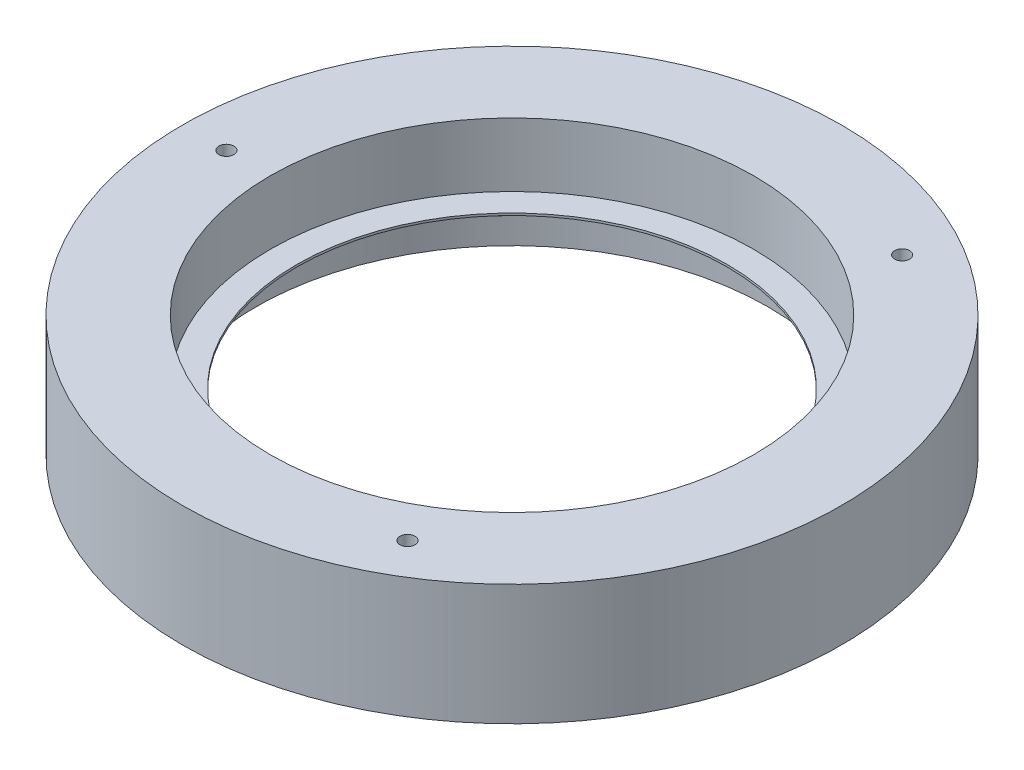
ISO-10303-21;
HEADER;
FILE_DESCRIPTION(('STEP AP214'),'2;1');
FILE_NAME('part.step','',(''),(''),'','','');
FILE_SCHEMA(('AUTOMOTIVE_DESIGN { 1 0 10303 214 1 1 1 1 }'));
ENDSEC;
DATA;
#1=APPLICATION_CONTEXT('core data for automotive mechanical design processes');
#2=APPLICATION_PROTOCOL_DEFINITION('international standard','automotive_design',2000,#1);
#3=PRODUCT_CONTEXT('',#1,'mechanical');
#4=PRODUCT('Part','Part','',(#3));
#5=PRODUCT_RELATED_PRODUCT_CATEGORY('part','',(#4));
#6=PRODUCT_DEFINITION_FORMATION('','',#4);
#7=PRODUCT_DEFINITION_CONTEXT('part definition',#1,'design');
#8=PRODUCT_DEFINITION('design','',#6,#7);
#9=PRODUCT_DEFINITION_SHAPE('','',#8);
#10=(LENGTH_UNIT() NAMED_UNIT(*) SI_UNIT(.MILLI.,.METRE.));
#11=(NAMED_UNIT(*) PLANE_ANGLE_UNIT() SI_UNIT($,.RADIAN.));
#12=(NAMED_UNIT(*) SI_UNIT($,.STERADIAN.) SOLID_ANGLE_UNIT());
#13=UNCERTAINTY_MEASURE_WITH_UNIT(LENGTH_MEASURE(1.E-05),#10,'distance_accuracy_value','');
#14=(GEOMETRIC_REPRESENTATION_CONTEXT(3) GLOBAL_UNCERTAINTY_ASSIGNED_CONTEXT((#13)) GLOBAL_UNIT_ASSIGNED_CONTEXT((#10,
#11,#12)) REPRESENTATION_CONTEXT('',''));
#15=CARTESIAN_POINT('',(0.,0.,0.));
#16=DIRECTION('',(0.,0.,1.));
#17=DIRECTION('',(1.,0.,0.));
#18=AXIS2_PLACEMENT_3D('',#15,#16,#17);
#19=CARTESIAN_POINT('',(0.,12.5,0.));
#20=DIRECTION('',(0.,-1.,0.));
#21=DIRECTION('',(0.,0.,-1.));
#22=AXIS2_PLACEMENT_3D('',#19,#20,#21);
#23=CONICAL_SURFACE('',#22,49.,0.959931088596879);
#24=CARTESIAN_POINT('',(0.,6.,0.));
#25=DIRECTION('',(0.,-1.,0.));
#26=DIRECTION('',(0.,0.,-1.));
#27=AXIS2_PLACEMENT_3D('',#24,#25,#26);
#28=CIRCLE('',#27,58.2829620438237);
#29=CARTESIAN_POINT('',(0.,6.,-58.2829620438237));
#30=VERTEX_POINT('',#29);
#31=EDGE_CURVE('E52',#30,#30,#28,.T.);
#32=ORIENTED_EDGE('',*,*,#31,.T.);
#33=EDGE_LOOP('',(#32));
#34=FACE_BOUND('',#33,.T.);
#35=CARTESIAN_POINT('',(0.,12.5,0.));
#36=DIRECTION('',(0.,-1.,0.));
#37=DIRECTION('',(0.,0.,-1.));
#38=AXIS2_PLACEMENT_3D('',#35,#36,#37);
#39=CIRCLE('',#38,49.);
#40=CARTESIAN_POINT('',(0.,12.5,-49.));
#41=VERTEX_POINT('',#40);
#42=EDGE_CURVE('E10',#41,#41,#39,.T.);
#43=ORIENTED_EDGE('',*,*,#42,.F.);
#44=EDGE_LOOP('',(#43));
#45=FACE_BOUND('',#44,.T.);
#46=ADVANCED_FACE('F34',(#34,#45),#23,.F.);
#47=CARTESIAN_POINT('',(0.,0.,0.));
#48=DIRECTION('',(0.,-1.,0.));
#49=DIRECTION('',(0.,0.,-1.));
#50=AXIS2_PLACEMENT_3D('',#47,#48,#49);
#51=CYLINDRICAL_SURFACE('',#50,49.);
#52=ORIENTED_EDGE('',*,*,#42,.T.);
#53=EDGE_LOOP('',(#52));
#54=FACE_BOUND('',#53,.T.);
#55=CARTESIAN_POINT('',(0.,13.,0.));
#56=DIRECTION('',(0.,-1.,0.));
#57=DIRECTION('',(0.,0.,-1.));
#58=AXIS2_PLACEMENT_3D('',#55,#56,#57);
#59=CIRCLE('',#58,49.);
#60=CARTESIAN_POINT('',(0.,13.,-49.));
#61=VERTEX_POINT('',#60);
#62=EDGE_CURVE('E41',#61,#61,#59,.T.);
#63=ORIENTED_EDGE('',*,*,#62,.F.);
#64=EDGE_LOOP('',(#63));
#65=FACE_BOUND('',#64,.T.);
#66=ADVANCED_FACE('F91',(#54,#65),#51,.F.);
#67=CARTESIAN_POINT('',(55.,13.,0.));
#68=DIRECTION('',(0.,1.,0.));
#69=DIRECTION('',(0.,0.,1.));
#70=AXIS2_PLACEMENT_3D('',#67,#68,#69);
#71=PLANE('',#70);
#72=ORIENTED_EDGE('',*,*,#62,.T.);
#73=EDGE_LOOP('',(#72));
#74=FACE_BOUND('',#73,.T.);
#75=CARTESIAN_POINT('',(0.,13.,0.));
#76=DIRECTION('',(0.,-1.,0.));
#77=DIRECTION('',(0.,0.,-1.));
#78=AXIS2_PLACEMENT_3D('',#75,#76,#77);
#79=CIRCLE('',#78,55.);
#80=CARTESIAN_POINT('',(0.,13.,-55.));
#81=VERTEX_POINT('',#80);
#82=EDGE_CURVE('E46',#81,#81,#79,.T.);
#83=ORIENTED_EDGE('',*,*,#82,.F.);
#84=EDGE_LOOP('',(#83));
#85=FACE_BOUND('',#84,.T.);
#86=ADVANCED_FACE('F89',(#74,#85),#71,.T.);
#87=CARTESIAN_POINT('',(0.,0.,0.));
#88=DIRECTION('',(0.,-1.,0.));
#89=DIRECTION('',(0.,0.,-1.));
#90=AXIS2_PLACEMENT_3D('',#87,#88,#89);
#91=CYLINDRICAL_SURFACE('',#90,55.);
#92=ORIENTED_EDGE('',*,*,#82,.T.);
#93=EDGE_LOOP('',(#92));
#94=FACE_BOUND('',#93,.T.);
#95=CARTESIAN_POINT('',(0.,27.5,0.));
#96=DIRECTION('',(0.,-1.,0.));
#97=DIRECTION('',(0.,0.,-1.));
#98=AXIS2_PLACEMENT_3D('',#95,#96,#97);
#99=CIRCLE('',#98,55.);
#100=CARTESIAN_POINT('',(0.,27.5,-55.));
#101=VERTEX_POINT('',#100);
#102=EDGE_CURVE('E81',#101,#101,#99,.T.);
#103=ORIENTED_EDGE('',*,*,#102,.F.);
#104=EDGE_LOOP('',(#103));
#105=FACE_BOUND('',#104,.T.);
#106=ADVANCED_FACE('F86',(#94,#105),#91,.F.);
#107=CARTESIAN_POINT('',(75.,27.5,0.));
#108=DIRECTION('',(0.,1.,0.));
#109=DIRECTION('',(0.,0.,1.));
#110=AXIS2_PLACEMENT_3D('',#107,#108,#109);
#111=PLANE('',#110);
#112=CARTESIAN_POINT('',(32.5000000000003,27.5,-56.2916512459884));
#113=DIRECTION('',(0.,1.,0.));
#114=DIRECTION('',(-0.866025403784436,0.,-0.500000000000004));
#115=AXIS2_PLACEMENT_3D('',#112,#113,#114);
#116=CIRCLE('',#115,1.70000000000001);
#117=CARTESIAN_POINT('',(31.0277568135667,27.5,-57.1416512459884));
#118=VERTEX_POINT('',#117);
#119=EDGE_CURVE('E56',#118,#118,#116,.T.);
#120=ORIENTED_EDGE('',*,*,#119,.F.);
#121=EDGE_LOOP('',(#120));
#122=FACE_BOUND('',#121,.T.);
#123=CARTESIAN_POINT('',(32.4999999999995,27.5,56.2916512459888));
#124=DIRECTION('',(0.,1.,0.));
#125=DIRECTION('',(0.866025403784443,0.,-0.499999999999992));
#126=AXIS2_PLACEMENT_3D('',#123,#124,#125);
#127=CIRCLE('',#126,1.70000000000001);
#128=CARTESIAN_POINT('',(33.972243186433,27.5,55.4416512459888));
#129=VERTEX_POINT('',#128);
#130=EDGE_CURVE('E61',#129,#129,#127,.T.);
#131=ORIENTED_EDGE('',*,*,#130,.F.);
#132=EDGE_LOOP('',(#131));
#133=FACE_BOUND('',#132,.T.);
#134=CARTESIAN_POINT('',(-65.,27.5,0.));
#135=DIRECTION('',(0.,1.,0.));
#136=DIRECTION('',(0.,0.,1.));
#137=AXIS2_PLACEMENT_3D('',#134,#135,#136);
#138=CIRCLE('',#137,1.70000000000001);
#139=CARTESIAN_POINT('',(-65.,27.5,1.70000000000001));
#140=VERTEX_POINT('',#139);
#141=EDGE_CURVE('E53',#140,#140,#138,.T.);
#142=ORIENTED_EDGE('',*,*,#141,.F.);
#143=EDGE_LOOP('',(#142));
#144=FACE_BOUND('',#143,.T.);
#145=ORIENTED_EDGE('',*,*,#102,.T.);
#146=EDGE_LOOP('',(#145));
#147=FACE_BOUND('',#146,.T.);
#148=CARTESIAN_POINT('',(0.,27.5,0.));
#149=DIRECTION('',(0.,-1.,0.));
#150=DIRECTION('',(0.,0.,-1.));
#151=AXIS2_PLACEMENT_3D('',#148,#149,#150);
#152=CIRCLE('',#151,75.);
#153=CARTESIAN_POINT('',(0.,27.5,-75.));
#154=VERTEX_POINT('',#153);
#155=EDGE_CURVE('E78',#154,#154,#152,.T.);
#156=ORIENTED_EDGE('',*,*,#155,.F.);
#157=EDGE_LOOP('',(#156));
#158=FACE_BOUND('',#157,.T.);
#159=ADVANCED_FACE('F98',(#122,#133,#144,#147,#158),#111,.T.);
#160=CARTESIAN_POINT('',(0.,0.,0.));
#161=DIRECTION('',(0.,-1.,0.));
#162=DIRECTION('',(0.,0.,-1.));
#163=AXIS2_PLACEMENT_3D('',#160,#161,#162);
#164=CYLINDRICAL_SURFACE('',#163,75.);
#165=ORIENTED_EDGE('',*,*,#155,.T.);
#166=EDGE_LOOP('',(#165));
#167=FACE_BOUND('',#166,.T.);
#168=CARTESIAN_POINT('',(0.,0.,0.));
#169=DIRECTION('',(0.,-1.,0.));
#170=DIRECTION('',(0.,0.,-1.));
#171=AXIS2_PLACEMENT_3D('',#168,#169,#170);
#172=CIRCLE('',#171,75.);
#173=CARTESIAN_POINT('',(0.,0.,-75.));
#174=VERTEX_POINT('',#173);
#175=EDGE_CURVE('E75',#174,#174,#172,.T.);
#176=ORIENTED_EDGE('',*,*,#175,.F.);
#177=EDGE_LOOP('',(#176));
#178=FACE_BOUND('',#177,.T.);
#179=ADVANCED_FACE('F120',(#167,#178),#164,.T.);
#180=CARTESIAN_POINT('',(58.2829620438237,0.,0.));
#181=DIRECTION('',(0.,-1.,0.));
#182=DIRECTION('',(0.,0.,-1.));
#183=AXIS2_PLACEMENT_3D('',#180,#181,#182);
#184=PLANE('',#183);
#185=CARTESIAN_POINT('',(32.5000000000003,0.,-56.2916512459884));
#186=DIRECTION('',(0.,-1.,0.));
#187=DIRECTION('',(0.,0.,-1.));
#188=AXIS2_PLACEMENT_3D('',#185,#186,#187);
#189=CIRCLE('',#188,1.70000000000001);
#190=CARTESIAN_POINT('',(32.5000000000003,0.,-57.9916512459884));
#191=VERTEX_POINT('',#190);
#192=EDGE_CURVE('E37',#191,#191,#189,.T.);
#193=ORIENTED_EDGE('',*,*,#192,.F.);
#194=EDGE_LOOP('',(#193));
#195=FACE_BOUND('',#194,.T.);
#196=CARTESIAN_POINT('',(32.4999999999995,0.,56.2916512459888));
#197=DIRECTION('',(0.,-1.,0.));
#198=DIRECTION('',(0.,0.,-1.));
#199=AXIS2_PLACEMENT_3D('',#196,#197,#198);
#200=CIRCLE('',#199,1.70000000000001);
#201=CARTESIAN_POINT('',(32.4999999999995,0.,54.5916512459888));
#202=VERTEX_POINT('',#201);
#203=EDGE_CURVE('E54',#202,#202,#200,.T.);
#204=ORIENTED_EDGE('',*,*,#203,.F.);
#205=EDGE_LOOP('',(#204));
#206=FACE_BOUND('',#205,.T.);
#207=CARTESIAN_POINT('',(-65.,0.,0.));
#208=DIRECTION('',(0.,-1.,0.));
#209=DIRECTION('',(0.,0.,-1.));
#210=AXIS2_PLACEMENT_3D('',#207,#208,#209);
#211=CIRCLE('',#210,1.70000000000001);
#212=CARTESIAN_POINT('',(-65.,0.,-1.70000000000001));
#213=VERTEX_POINT('',#212);
#214=EDGE_CURVE('E50',#213,#213,#211,.T.);
#215=ORIENTED_EDGE('',*,*,#214,.F.);
#216=EDGE_LOOP('',(#215));
#217=FACE_BOUND('',#216,.T.);
#218=ORIENTED_EDGE('',*,*,#175,.T.);
#219=EDGE_LOOP('',(#218));
#220=FACE_BOUND('',#219,.T.);
#221=CARTESIAN_POINT('',(0.,0.,0.));
#222=DIRECTION('',(0.,-1.,0.));
#223=DIRECTION('',(0.,0.,-1.));
#224=AXIS2_PLACEMENT_3D('',#221,#222,#223);
#225=CIRCLE('',#224,58.2829620438237);
#226=CARTESIAN_POINT('',(0.,0.,-58.2829620438237));
#227=VERTEX_POINT('',#226);
#228=EDGE_CURVE('E72',#227,#227,#225,.T.);
#229=ORIENTED_EDGE('',*,*,#228,.F.);
#230=EDGE_LOOP('',(#229));
#231=FACE_BOUND('',#230,.T.);
#232=ADVANCED_FACE('F110',(#195,#206,#217,#220,#231),#184,.T.);
#233=CARTESIAN_POINT('',(0.,0.,0.));
#234=DIRECTION('',(0.,-1.,0.));
#235=DIRECTION('',(0.,0.,-1.));
#236=AXIS2_PLACEMENT_3D('',#233,#234,#235);
#237=CYLINDRICAL_SURFACE('',#236,58.2829620438237);
#238=ORIENTED_EDGE('',*,*,#228,.T.);
#239=EDGE_LOOP('',(#238));
#240=FACE_BOUND('',#239,.T.);
#241=ORIENTED_EDGE('',*,*,#31,.F.);
#242=EDGE_LOOP('',(#241));
#243=FACE_BOUND('',#242,.T.);
#244=ADVANCED_FACE('F107',(#240,#243),#237,.F.);
#245=CARTESIAN_POINT('',(-65.,-31.5,0.));
#246=DIRECTION('',(0.,1.,0.));
#247=DIRECTION('',(0.,0.,1.));
#248=AXIS2_PLACEMENT_3D('',#245,#246,#247);
#249=CYLINDRICAL_SURFACE('',#248,1.70000000000001);
#250=ORIENTED_EDGE('',*,*,#214,.T.);
#251=EDGE_LOOP('',(#250));
#252=FACE_BOUND('',#251,.T.);
#253=ORIENTED_EDGE('',*,*,#141,.T.);
#254=EDGE_LOOP('',(#253));
#255=FACE_BOUND('',#254,.T.);
#256=ADVANCED_FACE('F109',(#252,#255),#249,.F.);
#257=CARTESIAN_POINT('',(32.4999999999995,-31.5,56.2916512459888));
#258=DIRECTION('',(0.,1.,0.));
#259=DIRECTION('',(0.,0.,1.));
#260=AXIS2_PLACEMENT_3D('',#257,#258,#259);
#261=CYLINDRICAL_SURFACE('',#260,1.70000000000001);
#262=ORIENTED_EDGE('',*,*,#203,.T.);
#263=EDGE_LOOP('',(#262));
#264=FACE_BOUND('',#263,.T.);
#265=ORIENTED_EDGE('',*,*,#130,.T.);
#266=EDGE_LOOP('',(#265));
#267=FACE_BOUND('',#266,.T.);
#268=ADVANCED_FACE('F117',(#264,#267),#261,.F.);
#269=CARTESIAN_POINT('',(32.5000000000003,-31.5,-56.2916512459884));
#270=DIRECTION('',(0.,1.,0.));
#271=DIRECTION('',(0.,0.,1.));
#272=AXIS2_PLACEMENT_3D('',#269,#270,#271);
#273=CYLINDRICAL_SURFACE('',#272,1.70000000000001);
#274=ORIENTED_EDGE('',*,*,#192,.T.);
#275=EDGE_LOOP('',(#274));
#276=FACE_BOUND('',#275,.T.);
#277=ORIENTED_EDGE('',*,*,#119,.T.);
#278=EDGE_LOOP('',(#277));
#279=FACE_BOUND('',#278,.T.);
#280=ADVANCED_FACE('F148',(#276,#279),#273,.F.);
#281=CLOSED_SHELL('',(#46,#66,#86,#106,#159,#179,#232,#244,#256,#268,#280));
#282=MANIFOLD_SOLID_BREP('B2',#281);
#283=ADVANCED_BREP_SHAPE_REPRESENTATION('',(#18,#282),#14);
#284=SHAPE_DEFINITION_REPRESENTATION(#9,#283);
ENDSEC;
END-ISO-10303-21;
